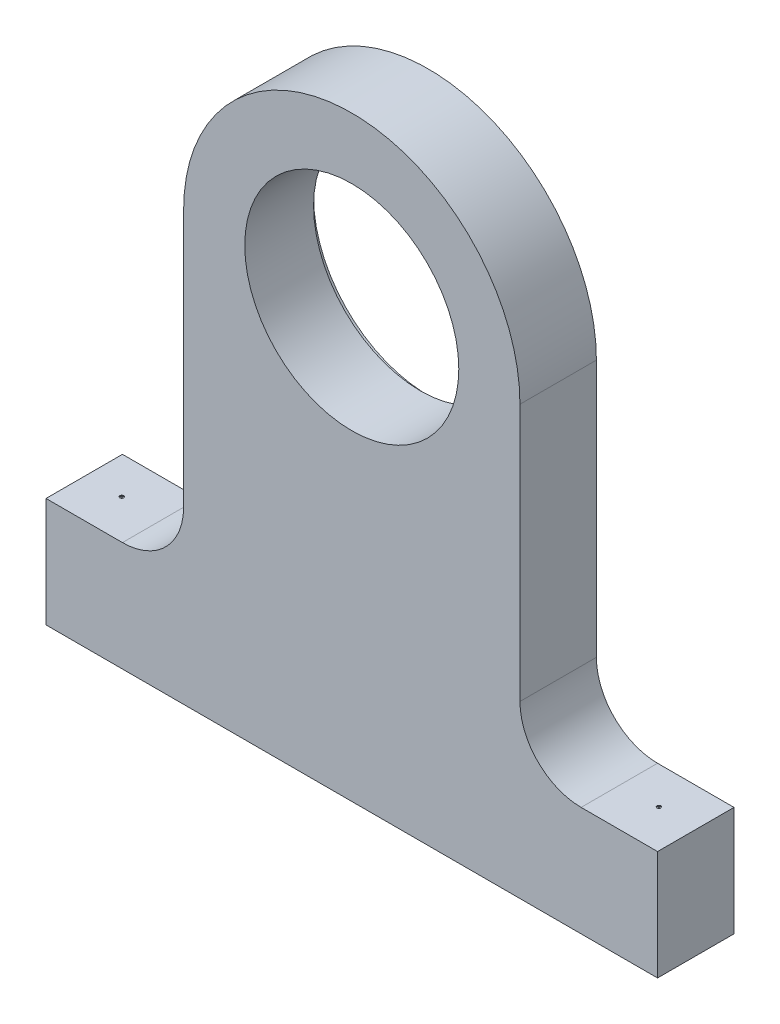
ISO-10303-21;
HEADER;
FILE_DESCRIPTION(('STEP AP214'),'2;1');
FILE_NAME('part.step','',(''),(''),'','','');
FILE_SCHEMA(('AUTOMOTIVE_DESIGN { 1 0 10303 214 1 1 1 1 }'));
ENDSEC;
DATA;
#1=APPLICATION_CONTEXT('core data for automotive mechanical design processes');
#2=APPLICATION_PROTOCOL_DEFINITION('international standard','automotive_design',2000,#1);
#3=PRODUCT_CONTEXT('',#1,'mechanical');
#4=PRODUCT('Part','Part','',(#3));
#5=PRODUCT_RELATED_PRODUCT_CATEGORY('part','',(#4));
#6=PRODUCT_DEFINITION_FORMATION('','',#4);
#7=PRODUCT_DEFINITION_CONTEXT('part definition',#1,'design');
#8=PRODUCT_DEFINITION('design','',#6,#7);
#9=PRODUCT_DEFINITION_SHAPE('','',#8);
#10=(LENGTH_UNIT() NAMED_UNIT(*) SI_UNIT(.MILLI.,.METRE.));
#11=(NAMED_UNIT(*) PLANE_ANGLE_UNIT() SI_UNIT($,.RADIAN.));
#12=(NAMED_UNIT(*) SI_UNIT($,.STERADIAN.) SOLID_ANGLE_UNIT());
#13=UNCERTAINTY_MEASURE_WITH_UNIT(LENGTH_MEASURE(1.E-05),#10,'distance_accuracy_value','');
#14=(GEOMETRIC_REPRESENTATION_CONTEXT(3) GLOBAL_UNCERTAINTY_ASSIGNED_CONTEXT((#13)) GLOBAL_UNIT_ASSIGNED_CONTEXT((#10,
#11,#12)) REPRESENTATION_CONTEXT('',''));
#15=CARTESIAN_POINT('',(0.,0.,0.));
#16=DIRECTION('',(0.,0.,1.));
#17=DIRECTION('',(1.,0.,0.));
#18=AXIS2_PLACEMENT_3D('',#15,#16,#17);
#19=CARTESIAN_POINT('',(21.4552238805972,126.865671641791,62.5));
#20=DIRECTION('',(0.,0.,-1.));
#21=DIRECTION('',(-1.,0.,0.));
#22=AXIS2_PLACEMENT_3D('',#19,#20,#21);
#23=PLANE('',#22);
#24=DIRECTION('',(0.,-1.,0.));
#25=VECTOR('',#24,1.);
#26=CARTESIAN_POINT('',(-228.544776119403,-223.134328358209,62.5));
#27=LINE('',#26,#25);
#28=CARTESIAN_POINT('',(-228.544776119403,-133.582089552239,62.5));
#29=VERTEX_POINT('',#28);
#30=CARTESIAN_POINT('',(-228.544776119403,-223.134328358209,62.5));
#31=VERTEX_POINT('',#30);
#32=EDGE_CURVE('E122',#29,#31,#27,.T.);
#33=ORIENTED_EDGE('',*,*,#32,.T.);
#34=DIRECTION('',(1.,0.,0.));
#35=VECTOR('',#34,1.);
#36=CARTESIAN_POINT('',(-228.544776119403,-223.134328358209,62.5));
#37=LINE('',#36,#35);
#38=CARTESIAN_POINT('',(271.455223880597,-223.134328358209,62.5));
#39=VERTEX_POINT('',#38);
#40=EDGE_CURVE('E111',#31,#39,#37,.T.);
#41=ORIENTED_EDGE('',*,*,#40,.T.);
#42=DIRECTION('',(0.,1.,0.));
#43=VECTOR('',#42,1.);
#44=CARTESIAN_POINT('',(271.455223880597,-223.134328358209,62.5));
#45=LINE('',#44,#43);
#46=CARTESIAN_POINT('',(271.455223880597,-133.582089552239,62.5));
#47=VERTEX_POINT('',#46);
#48=EDGE_CURVE('E121',#39,#47,#45,.T.);
#49=ORIENTED_EDGE('',*,*,#48,.T.);
#50=DIRECTION('',(-1.,0.,0.));
#51=VECTOR('',#50,1.);
#52=CARTESIAN_POINT('',(271.455223880597,-133.582089552239,62.5));
#53=LINE('',#52,#51);
#54=CARTESIAN_POINT('',(208.955223880597,-133.582089552239,62.5));
#55=VERTEX_POINT('',#54);
#56=EDGE_CURVE('E192',#47,#55,#53,.T.);
#57=ORIENTED_EDGE('',*,*,#56,.T.);
#58=CARTESIAN_POINT('',(208.955223880597,-83.5820895522389,62.5));
#59=DIRECTION('',(0.,0.,-1.));
#60=DIRECTION('',(-1.,0.,0.));
#61=AXIS2_PLACEMENT_3D('',#58,#59,#60);
#62=CIRCLE('',#61,50.);
#63=CARTESIAN_POINT('',(158.955223880597,-83.5820895522389,62.5));
#64=VERTEX_POINT('',#63);
#65=EDGE_CURVE('E11',#55,#64,#62,.T.);
#66=ORIENTED_EDGE('',*,*,#65,.T.);
#67=DIRECTION('',(0.,1.,0.));
#68=VECTOR('',#67,1.);
#69=CARTESIAN_POINT('',(158.955223880597,-133.582089552239,62.5));
#70=LINE('',#69,#68);
#71=CARTESIAN_POINT('',(158.955223880597,126.865671641791,62.5));
#72=VERTEX_POINT('',#71);
#73=EDGE_CURVE('E206',#64,#72,#70,.T.);
#74=ORIENTED_EDGE('',*,*,#73,.T.);
#75=CARTESIAN_POINT('',(21.4552238805972,126.865671641791,62.5));
#76=DIRECTION('',(0.,0.,1.));
#77=DIRECTION('',(-1.,0.,0.));
#78=AXIS2_PLACEMENT_3D('',#75,#76,#77);
#79=CIRCLE('',#78,137.5);
#80=CARTESIAN_POINT('',(-116.044776119403,126.865671641791,62.5));
#81=VERTEX_POINT('',#80);
#82=EDGE_CURVE('E204',#72,#81,#79,.T.);
#83=ORIENTED_EDGE('',*,*,#82,.T.);
#84=DIRECTION('',(0.,-1.,0.));
#85=VECTOR('',#84,1.);
#86=CARTESIAN_POINT('',(-116.044776119403,-133.582089552239,62.5));
#87=LINE('',#86,#85);
#88=CARTESIAN_POINT('',(-116.044776119403,-83.5820895522389,62.5));
#89=VERTEX_POINT('',#88);
#90=EDGE_CURVE('E157',#81,#89,#87,.T.);
#91=ORIENTED_EDGE('',*,*,#90,.T.);
#92=CARTESIAN_POINT('',(-166.044776119403,-83.5820895522389,62.5));
#93=DIRECTION('',(0.,0.,-1.));
#94=DIRECTION('',(-1.,0.,0.));
#95=AXIS2_PLACEMENT_3D('',#92,#93,#94);
#96=CIRCLE('',#95,50.);
#97=CARTESIAN_POINT('',(-166.044776119403,-133.582089552239,62.5));
#98=VERTEX_POINT('',#97);
#99=EDGE_CURVE('E152',#89,#98,#96,.T.);
#100=ORIENTED_EDGE('',*,*,#99,.T.);
#101=DIRECTION('',(-1.,0.,0.));
#102=VECTOR('',#101,1.);
#103=CARTESIAN_POINT('',(-228.544776119403,-133.582089552239,62.5));
#104=LINE('',#103,#102);
#105=EDGE_CURVE('E127',#98,#29,#104,.T.);
#106=ORIENTED_EDGE('',*,*,#105,.T.);
#107=EDGE_LOOP('',(#33,#41,#49,#57,#66,#74,#83,#91,#100,#106));
#108=FACE_BOUND('',#107,.T.);
#109=CARTESIAN_POINT('',(21.4552238805972,126.865671641791,62.5));
#110=DIRECTION('',(0.,0.,1.));
#111=DIRECTION('',(1.,0.,0.));
#112=AXIS2_PLACEMENT_3D('',#109,#110,#111);
#113=CIRCLE('',#112,87.5);
#114=CARTESIAN_POINT('',(108.955223880597,126.865671641791,62.5));
#115=VERTEX_POINT('',#114);
#116=EDGE_CURVE('E201',#115,#115,#113,.T.);
#117=ORIENTED_EDGE('',*,*,#116,.F.);
#118=EDGE_LOOP('',(#117));
#119=FACE_BOUND('',#118,.T.);
#120=ADVANCED_FACE('F33',(#108,#119),#23,.F.);
#121=CARTESIAN_POINT('',(21.4552238805972,126.865671641791,0.));
#122=DIRECTION('',(0.,0.,-1.));
#123=DIRECTION('',(-1.,0.,0.));
#124=AXIS2_PLACEMENT_3D('',#121,#122,#123);
#125=PLANE('',#124);
#126=CARTESIAN_POINT('',(21.4552238805972,126.865671641791,0.));
#127=DIRECTION('',(0.,0.,1.));
#128=DIRECTION('',(1.,0.,0.));
#129=AXIS2_PLACEMENT_3D('',#126,#127,#128);
#130=CIRCLE('',#129,93.75);
#131=CARTESIAN_POINT('',(115.205223880597,126.865671641791,0.));
#132=VERTEX_POINT('',#131);
#133=EDGE_CURVE('E212',#132,#132,#130,.T.);
#134=ORIENTED_EDGE('',*,*,#133,.T.);
#135=EDGE_LOOP('',(#134));
#136=FACE_BOUND('',#135,.T.);
#137=DIRECTION('',(0.,-1.,0.));
#138=VECTOR('',#137,1.);
#139=CARTESIAN_POINT('',(-228.544776119403,-223.134328358209,0.));
#140=LINE('',#139,#138);
#141=CARTESIAN_POINT('',(-228.544776119403,-133.582089552239,0.));
#142=VERTEX_POINT('',#141);
#143=CARTESIAN_POINT('',(-228.544776119403,-223.134328358209,0.));
#144=VERTEX_POINT('',#143);
#145=EDGE_CURVE('E135',#142,#144,#140,.T.);
#146=ORIENTED_EDGE('',*,*,#145,.F.);
#147=DIRECTION('',(-1.,0.,0.));
#148=VECTOR('',#147,1.);
#149=CARTESIAN_POINT('',(-228.544776119403,-133.582089552239,0.));
#150=LINE('',#149,#148);
#151=CARTESIAN_POINT('',(-166.044776119403,-133.582089552239,0.));
#152=VERTEX_POINT('',#151);
#153=EDGE_CURVE('E131',#152,#142,#150,.T.);
#154=ORIENTED_EDGE('',*,*,#153,.F.);
#155=CARTESIAN_POINT('',(-166.044776119403,-83.5820895522389,0.));
#156=DIRECTION('',(0.,0.,-1.));
#157=DIRECTION('',(-1.,0.,0.));
#158=AXIS2_PLACEMENT_3D('',#155,#156,#157);
#159=CIRCLE('',#158,50.);
#160=CARTESIAN_POINT('',(-116.044776119403,-83.5820895522389,0.));
#161=VERTEX_POINT('',#160);
#162=EDGE_CURVE('E150',#152,#161,#159,.F.);
#163=ORIENTED_EDGE('',*,*,#162,.T.);
#164=DIRECTION('',(0.,-1.,0.));
#165=VECTOR('',#164,1.);
#166=CARTESIAN_POINT('',(-116.044776119403,-133.582089552239,0.));
#167=LINE('',#166,#165);
#168=CARTESIAN_POINT('',(-116.044776119403,126.865671641791,0.));
#169=VERTEX_POINT('',#168);
#170=EDGE_CURVE('E171',#169,#161,#167,.T.);
#171=ORIENTED_EDGE('',*,*,#170,.F.);
#172=CARTESIAN_POINT('',(21.4552238805972,126.865671641791,0.));
#173=DIRECTION('',(0.,0.,1.));
#174=DIRECTION('',(-1.,0.,0.));
#175=AXIS2_PLACEMENT_3D('',#172,#173,#174);
#176=CIRCLE('',#175,137.5);
#177=CARTESIAN_POINT('',(158.955223880597,126.865671641791,0.));
#178=VERTEX_POINT('',#177);
#179=EDGE_CURVE('E177',#178,#169,#176,.T.);
#180=ORIENTED_EDGE('',*,*,#179,.F.);
#181=DIRECTION('',(0.,1.,0.));
#182=VECTOR('',#181,1.);
#183=CARTESIAN_POINT('',(158.955223880597,-133.582089552239,0.));
#184=LINE('',#183,#182);
#185=CARTESIAN_POINT('',(158.955223880597,-83.5820895522389,0.));
#186=VERTEX_POINT('',#185);
#187=EDGE_CURVE('E180',#186,#178,#184,.T.);
#188=ORIENTED_EDGE('',*,*,#187,.F.);
#189=CARTESIAN_POINT('',(208.955223880597,-83.5820895522389,0.));
#190=DIRECTION('',(0.,0.,-1.));
#191=DIRECTION('',(-1.,0.,0.));
#192=AXIS2_PLACEMENT_3D('',#189,#190,#191);
#193=CIRCLE('',#192,50.);
#194=CARTESIAN_POINT('',(208.955223880597,-133.582089552239,0.));
#195=VERTEX_POINT('',#194);
#196=EDGE_CURVE('E42',#186,#195,#193,.F.);
#197=ORIENTED_EDGE('',*,*,#196,.T.);
#198=DIRECTION('',(-1.,0.,0.));
#199=VECTOR('',#198,1.);
#200=CARTESIAN_POINT('',(271.455223880597,-133.582089552239,0.));
#201=LINE('',#200,#199);
#202=CARTESIAN_POINT('',(271.455223880597,-133.582089552239,0.));
#203=VERTEX_POINT('',#202);
#204=EDGE_CURVE('E191',#203,#195,#201,.T.);
#205=ORIENTED_EDGE('',*,*,#204,.F.);
#206=DIRECTION('',(0.,1.,0.));
#207=VECTOR('',#206,1.);
#208=CARTESIAN_POINT('',(271.455223880597,-223.134328358209,0.));
#209=LINE('',#208,#207);
#210=CARTESIAN_POINT('',(271.455223880597,-223.134328358209,0.));
#211=VERTEX_POINT('',#210);
#212=EDGE_CURVE('E195',#211,#203,#209,.T.);
#213=ORIENTED_EDGE('',*,*,#212,.F.);
#214=DIRECTION('',(1.,0.,0.));
#215=VECTOR('',#214,1.);
#216=CARTESIAN_POINT('',(-228.544776119403,-223.134328358209,0.));
#217=LINE('',#216,#215);
#218=EDGE_CURVE('E197',#144,#211,#217,.T.);
#219=ORIENTED_EDGE('',*,*,#218,.F.);
#220=EDGE_LOOP('',(#146,#154,#163,#171,#180,#188,#197,#205,#213,#219));
#221=FACE_BOUND('',#220,.T.);
#222=ADVANCED_FACE('F169',(#136,#221),#125,.T.);
#223=CARTESIAN_POINT('',(-228.544776119403,-223.134328358209,62.5));
#224=DIRECTION('',(1.,0.,0.));
#225=DIRECTION('',(0.,0.,-1.));
#226=AXIS2_PLACEMENT_3D('',#223,#224,#225);
#227=PLANE('',#226);
#228=ORIENTED_EDGE('',*,*,#145,.T.);
#229=DIRECTION('',(0.,0.,-1.));
#230=VECTOR('',#229,1.);
#231=CARTESIAN_POINT('',(-228.544776119403,-223.134328358209,62.5));
#232=LINE('',#231,#230);
#233=EDGE_CURVE('E115',#31,#144,#232,.T.);
#234=ORIENTED_EDGE('',*,*,#233,.F.);
#235=ORIENTED_EDGE('',*,*,#32,.F.);
#236=DIRECTION('',(0.,0.,-1.));
#237=VECTOR('',#236,1.);
#238=CARTESIAN_POINT('',(-228.544776119403,-133.582089552239,62.5));
#239=LINE('',#238,#237);
#240=EDGE_CURVE('E164',#29,#142,#239,.T.);
#241=ORIENTED_EDGE('',*,*,#240,.T.);
#242=EDGE_LOOP('',(#228,#234,#235,#241));
#243=FACE_BOUND('',#242,.T.);
#244=ADVANCED_FACE('F133',(#243),#227,.F.);
#245=CARTESIAN_POINT('',(-228.544776119403,-223.134328358209,62.5));
#246=DIRECTION('',(0.,1.,0.));
#247=DIRECTION('',(0.,0.,1.));
#248=AXIS2_PLACEMENT_3D('',#245,#246,#247);
#249=PLANE('',#248);
#250=CARTESIAN_POINT('',(-198.798502653569,-223.134328358209,30.3253458439218));
#251=DIRECTION('',(0.,1.,0.));
#252=DIRECTION('',(0.,0.,1.));
#253=AXIS2_PLACEMENT_3D('',#250,#251,#252);
#254=CIRCLE('',#253,0.698499999999991);
#255=CARTESIAN_POINT('',(-198.798502653569,-223.134328358209,31.0238458439218));
#256=VERTEX_POINT('',#255);
#257=EDGE_CURVE('E230',#256,#256,#254,.T.);
#258=ORIENTED_EDGE('',*,*,#257,.T.);
#259=EDGE_LOOP('',(#258));
#260=FACE_BOUND('',#259,.T.);
#261=CARTESIAN_POINT('',(240.412221484092,-223.134328358209,30.3253458439218));
#262=DIRECTION('',(0.,1.,0.));
#263=DIRECTION('',(0.,0.,1.));
#264=AXIS2_PLACEMENT_3D('',#261,#262,#263);
#265=CIRCLE('',#264,0.698499999999991);
#266=CARTESIAN_POINT('',(240.412221484092,-223.134328358209,31.0238458439218));
#267=VERTEX_POINT('',#266);
#268=EDGE_CURVE('E216',#267,#267,#265,.T.);
#269=ORIENTED_EDGE('',*,*,#268,.T.);
#270=EDGE_LOOP('',(#269));
#271=FACE_BOUND('',#270,.T.);
#272=ORIENTED_EDGE('',*,*,#218,.T.);
#273=DIRECTION('',(0.,0.,-1.));
#274=VECTOR('',#273,1.);
#275=CARTESIAN_POINT('',(271.455223880597,-223.134328358209,62.5));
#276=LINE('',#275,#274);
#277=EDGE_CURVE('E118',#39,#211,#276,.T.);
#278=ORIENTED_EDGE('',*,*,#277,.F.);
#279=ORIENTED_EDGE('',*,*,#40,.F.);
#280=ORIENTED_EDGE('',*,*,#233,.T.);
#281=EDGE_LOOP('',(#272,#278,#279,#280));
#282=FACE_BOUND('',#281,.T.);
#283=ADVANCED_FACE('F113',(#260,#271,#282),#249,.F.);
#284=CARTESIAN_POINT('',(271.455223880597,-223.134328358209,62.5));
#285=DIRECTION('',(-1.,0.,0.));
#286=DIRECTION('',(0.,0.,1.));
#287=AXIS2_PLACEMENT_3D('',#284,#285,#286);
#288=PLANE('',#287);
#289=ORIENTED_EDGE('',*,*,#212,.T.);
#290=DIRECTION('',(0.,0.,-1.));
#291=VECTOR('',#290,1.);
#292=CARTESIAN_POINT('',(271.455223880597,-133.582089552239,62.5));
#293=LINE('',#292,#291);
#294=EDGE_CURVE('E141',#47,#203,#293,.T.);
#295=ORIENTED_EDGE('',*,*,#294,.F.);
#296=ORIENTED_EDGE('',*,*,#48,.F.);
#297=ORIENTED_EDGE('',*,*,#277,.T.);
#298=EDGE_LOOP('',(#289,#295,#296,#297));
#299=FACE_BOUND('',#298,.T.);
#300=ADVANCED_FACE('F365',(#299),#288,.F.);
#301=CARTESIAN_POINT('',(271.455223880597,-133.582089552239,62.5));
#302=DIRECTION('',(0.,-1.,0.));
#303=DIRECTION('',(1.,0.,0.));
#304=AXIS2_PLACEMENT_3D('',#301,#302,#303);
#305=PLANE('',#304);
#306=CARTESIAN_POINT('',(240.412221484092,-133.582089552239,30.3253458439218));
#307=DIRECTION('',(0.,1.,0.));
#308=DIRECTION('',(0.,0.,1.));
#309=AXIS2_PLACEMENT_3D('',#306,#307,#308);
#310=CIRCLE('',#309,1.58749999999999);
#311=CARTESIAN_POINT('',(240.412221484092,-133.582089552239,31.9128458439218));
#312=VERTEX_POINT('',#311);
#313=EDGE_CURVE('E227',#312,#312,#310,.T.);
#314=ORIENTED_EDGE('',*,*,#313,.F.);
#315=EDGE_LOOP('',(#314));
#316=FACE_BOUND('',#315,.T.);
#317=ORIENTED_EDGE('',*,*,#204,.T.);
#318=DIRECTION('',(0.,0.,-1.));
#319=VECTOR('',#318,1.);
#320=CARTESIAN_POINT('',(208.955223880597,-133.582089552239,62.5));
#321=LINE('',#320,#319);
#322=EDGE_CURVE('E49',#195,#55,#321,.F.);
#323=ORIENTED_EDGE('',*,*,#322,.T.);
#324=ORIENTED_EDGE('',*,*,#56,.F.);
#325=ORIENTED_EDGE('',*,*,#294,.T.);
#326=EDGE_LOOP('',(#317,#323,#324,#325));
#327=FACE_BOUND('',#326,.T.);
#328=ADVANCED_FACE('F190',(#316,#327),#305,.F.);
#329=CARTESIAN_POINT('',(158.955223880597,-133.582089552239,62.5));
#330=DIRECTION('',(-1.,0.,0.));
#331=DIRECTION('',(0.,-1.,0.));
#332=AXIS2_PLACEMENT_3D('',#329,#330,#331);
#333=PLANE('',#332);
#334=ORIENTED_EDGE('',*,*,#73,.F.);
#335=DIRECTION('',(0.,0.,-1.));
#336=VECTOR('',#335,1.);
#337=CARTESIAN_POINT('',(158.955223880597,-83.5820895522389,0.));
#338=LINE('',#337,#336);
#339=EDGE_CURVE('E146',#64,#186,#338,.T.);
#340=ORIENTED_EDGE('',*,*,#339,.T.);
#341=ORIENTED_EDGE('',*,*,#187,.T.);
#342=DIRECTION('',(0.,0.,-1.));
#343=VECTOR('',#342,1.);
#344=CARTESIAN_POINT('',(158.955223880597,126.865671641791,62.5));
#345=LINE('',#344,#343);
#346=EDGE_CURVE('E186',#72,#178,#345,.T.);
#347=ORIENTED_EDGE('',*,*,#346,.F.);
#348=EDGE_LOOP('',(#334,#340,#341,#347));
#349=FACE_BOUND('',#348,.T.);
#350=ADVANCED_FACE('F379',(#349),#333,.F.);
#351=CARTESIAN_POINT('',(21.4552238805972,126.865671641791,62.5));
#352=DIRECTION('',(0.,0.,-1.));
#353=DIRECTION('',(-1.,0.,0.));
#354=AXIS2_PLACEMENT_3D('',#351,#352,#353);
#355=CYLINDRICAL_SURFACE('',#354,137.5);
#356=ORIENTED_EDGE('',*,*,#179,.T.);
#357=DIRECTION('',(0.,0.,-1.));
#358=VECTOR('',#357,1.);
#359=CARTESIAN_POINT('',(-116.044776119403,126.865671641791,62.5));
#360=LINE('',#359,#358);
#361=EDGE_CURVE('E176',#81,#169,#360,.T.);
#362=ORIENTED_EDGE('',*,*,#361,.F.);
#363=ORIENTED_EDGE('',*,*,#82,.F.);
#364=ORIENTED_EDGE('',*,*,#346,.T.);
#365=EDGE_LOOP('',(#356,#362,#363,#364));
#366=FACE_BOUND('',#365,.T.);
#367=ADVANCED_FACE('F254',(#366),#355,.T.);
#368=CARTESIAN_POINT('',(-116.044776119403,-133.582089552239,62.5));
#369=DIRECTION('',(1.,0.,0.));
#370=DIRECTION('',(0.,1.,0.));
#371=AXIS2_PLACEMENT_3D('',#368,#369,#370);
#372=PLANE('',#371);
#373=ORIENTED_EDGE('',*,*,#170,.T.);
#374=DIRECTION('',(0.,0.,-1.));
#375=VECTOR('',#374,1.);
#376=CARTESIAN_POINT('',(-116.044776119403,-83.5820895522389,62.5));
#377=LINE('',#376,#375);
#378=EDGE_CURVE('E139',#161,#89,#377,.F.);
#379=ORIENTED_EDGE('',*,*,#378,.T.);
#380=ORIENTED_EDGE('',*,*,#90,.F.);
#381=ORIENTED_EDGE('',*,*,#361,.T.);
#382=EDGE_LOOP('',(#373,#379,#380,#381));
#383=FACE_BOUND('',#382,.T.);
#384=ADVANCED_FACE('F174',(#383),#372,.F.);
#385=CARTESIAN_POINT('',(-228.544776119403,-133.582089552239,62.5));
#386=DIRECTION('',(0.,-1.,0.));
#387=DIRECTION('',(0.,0.,-1.));
#388=AXIS2_PLACEMENT_3D('',#385,#386,#387);
#389=PLANE('',#388);
#390=CARTESIAN_POINT('',(-198.798502653569,-133.582089552239,30.3253458439218));
#391=DIRECTION('',(0.,1.,0.));
#392=DIRECTION('',(0.,0.,1.));
#393=AXIS2_PLACEMENT_3D('',#390,#391,#392);
#394=CIRCLE('',#393,1.58749999999999);
#395=CARTESIAN_POINT('',(-198.798502653569,-133.582089552239,31.9128458439218));
#396=VERTEX_POINT('',#395);
#397=EDGE_CURVE('E239',#396,#396,#394,.T.);
#398=ORIENTED_EDGE('',*,*,#397,.F.);
#399=EDGE_LOOP('',(#398));
#400=FACE_BOUND('',#399,.T.);
#401=ORIENTED_EDGE('',*,*,#105,.F.);
#402=DIRECTION('',(0.,0.,-1.));
#403=VECTOR('',#402,1.);
#404=CARTESIAN_POINT('',(-166.044776119403,-133.582089552239,0.));
#405=LINE('',#404,#403);
#406=EDGE_CURVE('E136',#98,#152,#405,.T.);
#407=ORIENTED_EDGE('',*,*,#406,.T.);
#408=ORIENTED_EDGE('',*,*,#153,.T.);
#409=ORIENTED_EDGE('',*,*,#240,.F.);
#410=EDGE_LOOP('',(#401,#407,#408,#409));
#411=FACE_BOUND('',#410,.T.);
#412=ADVANCED_FACE('F162',(#400,#411),#389,.F.);
#413=CARTESIAN_POINT('',(21.4552238805972,126.865671641791,62.5));
#414=DIRECTION('',(0.,0.,-1.));
#415=DIRECTION('',(-1.,0.,0.));
#416=AXIS2_PLACEMENT_3D('',#413,#414,#415);
#417=CYLINDRICAL_SURFACE('',#416,87.5);
#418=CARTESIAN_POINT('',(21.4552238805972,126.865671641791,6.25));
#419=DIRECTION('',(0.,0.,1.));
#420=DIRECTION('',(1.,0.,0.));
#421=AXIS2_PLACEMENT_3D('',#418,#419,#420);
#422=CIRCLE('',#421,87.5);
#423=CARTESIAN_POINT('',(108.955223880597,126.865671641791,6.25));
#424=VERTEX_POINT('',#423);
#425=EDGE_CURVE('E37',#424,#424,#422,.T.);
#426=ORIENTED_EDGE('',*,*,#425,.F.);
#427=EDGE_LOOP('',(#426));
#428=FACE_BOUND('',#427,.T.);
#429=ORIENTED_EDGE('',*,*,#116,.T.);
#430=EDGE_LOOP('',(#429));
#431=FACE_BOUND('',#430,.T.);
#432=ADVANCED_FACE('F246',(#428,#431),#417,.F.);
#433=CARTESIAN_POINT('',(-166.044776119403,-83.5820895522389,62.5));
#434=DIRECTION('',(0.,0.,1.));
#435=DIRECTION('',(1.,0.,0.));
#436=AXIS2_PLACEMENT_3D('',#433,#434,#435);
#437=CYLINDRICAL_SURFACE('',#436,50.);
#438=ORIENTED_EDGE('',*,*,#99,.F.);
#439=ORIENTED_EDGE('',*,*,#378,.F.);
#440=ORIENTED_EDGE('',*,*,#162,.F.);
#441=ORIENTED_EDGE('',*,*,#406,.F.);
#442=EDGE_LOOP('',(#438,#439,#440,#441));
#443=FACE_BOUND('',#442,.T.);
#444=ADVANCED_FACE('F166',(#443),#437,.F.);
#445=CARTESIAN_POINT('',(208.955223880597,-83.5820895522389,62.5));
#446=DIRECTION('',(0.,0.,1.));
#447=DIRECTION('',(1.,0.,0.));
#448=AXIS2_PLACEMENT_3D('',#445,#446,#447);
#449=CYLINDRICAL_SURFACE('',#448,50.);
#450=ORIENTED_EDGE('',*,*,#65,.F.);
#451=ORIENTED_EDGE('',*,*,#322,.F.);
#452=ORIENTED_EDGE('',*,*,#196,.F.);
#453=ORIENTED_EDGE('',*,*,#339,.F.);
#454=EDGE_LOOP('',(#450,#451,#452,#453));
#455=FACE_BOUND('',#454,.T.);
#456=ADVANCED_FACE('F35',(#455),#449,.F.);
#457=CARTESIAN_POINT('',(21.4552238805972,126.865671641791,6.25));
#458=DIRECTION('',(0.,0.,-1.));
#459=DIRECTION('',(-1.,0.,0.));
#460=AXIS2_PLACEMENT_3D('',#457,#458,#459);
#461=CYLINDRICAL_SURFACE('',#460,93.75);
#462=CARTESIAN_POINT('',(21.4552238805972,126.865671641791,6.25));
#463=DIRECTION('',(0.,0.,1.));
#464=DIRECTION('',(1.,0.,0.));
#465=AXIS2_PLACEMENT_3D('',#462,#463,#464);
#466=CIRCLE('',#465,93.75);
#467=CARTESIAN_POINT('',(115.205223880597,126.865671641791,6.25));
#468=VERTEX_POINT('',#467);
#469=EDGE_CURVE('E215',#468,#468,#466,.T.);
#470=ORIENTED_EDGE('',*,*,#469,.T.);
#471=EDGE_LOOP('',(#470));
#472=FACE_BOUND('',#471,.T.);
#473=ORIENTED_EDGE('',*,*,#133,.F.);
#474=EDGE_LOOP('',(#473));
#475=FACE_BOUND('',#474,.T.);
#476=ADVANCED_FACE('F264',(#472,#475),#461,.F.);
#477=CARTESIAN_POINT('',(21.4552238805972,126.865671641791,6.25));
#478=DIRECTION('',(0.,0.,1.));
#479=DIRECTION('',(1.,0.,0.));
#480=AXIS2_PLACEMENT_3D('',#477,#478,#479);
#481=PLANE('',#480);
#482=ORIENTED_EDGE('',*,*,#425,.T.);
#483=EDGE_LOOP('',(#482));
#484=FACE_BOUND('',#483,.T.);
#485=ORIENTED_EDGE('',*,*,#469,.F.);
#486=EDGE_LOOP('',(#485));
#487=FACE_BOUND('',#486,.T.);
#488=ADVANCED_FACE('F267',(#484,#487),#481,.F.);
#489=CARTESIAN_POINT('',(240.412221484092,-133.582089552239,30.3253458439218));
#490=DIRECTION('',(0.,1.,0.));
#491=DIRECTION('',(0.,0.,1.));
#492=AXIS2_PLACEMENT_3D('',#489,#490,#491);
#493=CYLINDRICAL_SURFACE('',#492,0.698499999999991);
#494=ORIENTED_EDGE('',*,*,#268,.F.);
#495=EDGE_LOOP('',(#494));
#496=FACE_BOUND('',#495,.T.);
#497=CARTESIAN_POINT('',(240.412221484092,-134.293289552239,30.3253458439218));
#498=DIRECTION('',(0.,1.,0.));
#499=DIRECTION('',(0.,0.,1.));
#500=AXIS2_PLACEMENT_3D('',#497,#498,#499);
#501=CIRCLE('',#500,0.698499999999991);
#502=CARTESIAN_POINT('',(240.412221484092,-134.293289552239,31.0238458439218));
#503=VERTEX_POINT('',#502);
#504=EDGE_CURVE('E221',#503,#503,#501,.T.);
#505=ORIENTED_EDGE('',*,*,#504,.T.);
#506=EDGE_LOOP('',(#505));
#507=FACE_BOUND('',#506,.T.);
#508=ADVANCED_FACE('F271',(#496,#507),#493,.F.);
#509=CARTESIAN_POINT('',(241.110721484092,-134.293289552239,30.3253458439218));
#510=DIRECTION('',(0.,-1.,0.));
#511=DIRECTION('',(0.,0.,-1.));
#512=AXIS2_PLACEMENT_3D('',#509,#510,#511);
#513=PLANE('',#512);
#514=ORIENTED_EDGE('',*,*,#504,.F.);
#515=EDGE_LOOP('',(#514));
#516=FACE_BOUND('',#515,.T.);
#517=CARTESIAN_POINT('',(240.412221484092,-134.293289552239,30.3253458439218));
#518=DIRECTION('',(0.,1.,0.));
#519=DIRECTION('',(0.,0.,1.));
#520=AXIS2_PLACEMENT_3D('',#517,#518,#519);
#521=CIRCLE('',#520,1.58749999999999);
#522=CARTESIAN_POINT('',(240.412221484092,-134.293289552239,31.9128458439218));
#523=VERTEX_POINT('',#522);
#524=EDGE_CURVE('E224',#523,#523,#521,.T.);
#525=ORIENTED_EDGE('',*,*,#524,.T.);
#526=EDGE_LOOP('',(#525));
#527=FACE_BOUND('',#526,.T.);
#528=ADVANCED_FACE('F275',(#516,#527),#513,.F.);
#529=CARTESIAN_POINT('',(240.412221484092,-133.582089552239,30.3253458439218));
#530=DIRECTION('',(0.,1.,0.));
#531=DIRECTION('',(0.,0.,1.));
#532=AXIS2_PLACEMENT_3D('',#529,#530,#531);
#533=CYLINDRICAL_SURFACE('',#532,1.58749999999999);
#534=ORIENTED_EDGE('',*,*,#524,.F.);
#535=EDGE_LOOP('',(#534));
#536=FACE_BOUND('',#535,.T.);
#537=ORIENTED_EDGE('',*,*,#313,.T.);
#538=EDGE_LOOP('',(#537));
#539=FACE_BOUND('',#538,.T.);
#540=ADVANCED_FACE('F279',(#536,#539),#533,.F.);
#541=CARTESIAN_POINT('',(-198.798502653569,-133.582089552239,30.3253458439218));
#542=DIRECTION('',(0.,1.,0.));
#543=DIRECTION('',(0.,0.,1.));
#544=AXIS2_PLACEMENT_3D('',#541,#542,#543);
#545=CYLINDRICAL_SURFACE('',#544,0.698499999999991);
#546=ORIENTED_EDGE('',*,*,#257,.F.);
#547=EDGE_LOOP('',(#546));
#548=FACE_BOUND('',#547,.T.);
#549=CARTESIAN_POINT('',(-198.798502653569,-134.293289552239,30.3253458439218));
#550=DIRECTION('',(0.,1.,0.));
#551=DIRECTION('',(0.,0.,1.));
#552=AXIS2_PLACEMENT_3D('',#549,#550,#551);
#553=CIRCLE('',#552,0.698499999999991);
#554=CARTESIAN_POINT('',(-198.798502653569,-134.293289552239,31.0238458439218));
#555=VERTEX_POINT('',#554);
#556=EDGE_CURVE('E233',#555,#555,#553,.T.);
#557=ORIENTED_EDGE('',*,*,#556,.T.);
#558=EDGE_LOOP('',(#557));
#559=FACE_BOUND('',#558,.T.);
#560=ADVANCED_FACE('F283',(#548,#559),#545,.F.);
#561=CARTESIAN_POINT('',(-198.100002653569,-134.293289552239,30.3253458439218));
#562=DIRECTION('',(0.,-1.,0.));
#563=DIRECTION('',(0.,0.,-1.));
#564=AXIS2_PLACEMENT_3D('',#561,#562,#563);
#565=PLANE('',#564);
#566=ORIENTED_EDGE('',*,*,#556,.F.);
#567=EDGE_LOOP('',(#566));
#568=FACE_BOUND('',#567,.T.);
#569=CARTESIAN_POINT('',(-198.798502653569,-134.293289552239,30.3253458439218));
#570=DIRECTION('',(0.,1.,0.));
#571=DIRECTION('',(0.,0.,1.));
#572=AXIS2_PLACEMENT_3D('',#569,#570,#571);
#573=CIRCLE('',#572,1.58749999999999);
#574=CARTESIAN_POINT('',(-198.798502653569,-134.293289552239,31.9128458439218));
#575=VERTEX_POINT('',#574);
#576=EDGE_CURVE('E236',#575,#575,#573,.T.);
#577=ORIENTED_EDGE('',*,*,#576,.T.);
#578=EDGE_LOOP('',(#577));
#579=FACE_BOUND('',#578,.T.);
#580=ADVANCED_FACE('F287',(#568,#579),#565,.F.);
#581=CARTESIAN_POINT('',(-198.798502653569,-133.582089552239,30.3253458439218));
#582=DIRECTION('',(0.,1.,0.));
#583=DIRECTION('',(0.,0.,1.));
#584=AXIS2_PLACEMENT_3D('',#581,#582,#583);
#585=CYLINDRICAL_SURFACE('',#584,1.58749999999999);
#586=ORIENTED_EDGE('',*,*,#576,.F.);
#587=EDGE_LOOP('',(#586));
#588=FACE_BOUND('',#587,.T.);
#589=ORIENTED_EDGE('',*,*,#397,.T.);
#590=EDGE_LOOP('',(#589));
#591=FACE_BOUND('',#590,.T.);
#592=ADVANCED_FACE('F243',(#588,#591),#585,.F.);
#593=CLOSED_SHELL('',(#120,#222,#244,#283,#300,#328,#350,#367,#384,#412,#432,#444,#456,#476,
#488,#508,#528,#540,#560,#580,#592));
#594=MANIFOLD_SOLID_BREP('B2',#593);
#595=ADVANCED_BREP_SHAPE_REPRESENTATION('',(#18,#594),#14);
#596=SHAPE_DEFINITION_REPRESENTATION(#9,#595);
ENDSEC;
END-ISO-10303-21;
